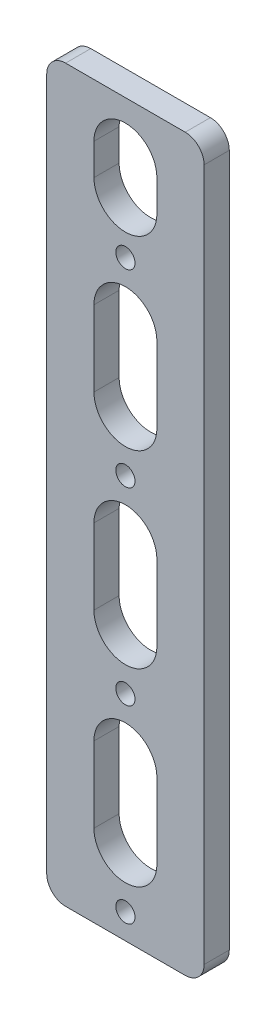
ISO-10303-21;
HEADER;
FILE_DESCRIPTION(('STEP AP214'),'2;1');
FILE_NAME('part.step','',(''),(''),'','','');
FILE_SCHEMA(('AUTOMOTIVE_DESIGN { 1 0 10303 214 1 1 1 1 }'));
ENDSEC;
DATA;
#1=APPLICATION_CONTEXT('core data for automotive mechanical design processes');
#2=APPLICATION_PROTOCOL_DEFINITION('international standard','automotive_design',2000,#1);
#3=PRODUCT_CONTEXT('',#1,'mechanical');
#4=PRODUCT('Part','Part','',(#3));
#5=PRODUCT_RELATED_PRODUCT_CATEGORY('part','',(#4));
#6=PRODUCT_DEFINITION_FORMATION('','',#4);
#7=PRODUCT_DEFINITION_CONTEXT('part definition',#1,'design');
#8=PRODUCT_DEFINITION('design','',#6,#7);
#9=PRODUCT_DEFINITION_SHAPE('','',#8);
#10=(LENGTH_UNIT() NAMED_UNIT(*) SI_UNIT(.MILLI.,.METRE.));
#11=(NAMED_UNIT(*) PLANE_ANGLE_UNIT() SI_UNIT($,.RADIAN.));
#12=(NAMED_UNIT(*) SI_UNIT($,.STERADIAN.) SOLID_ANGLE_UNIT());
#13=UNCERTAINTY_MEASURE_WITH_UNIT(LENGTH_MEASURE(1.E-05),#10,'distance_accuracy_value','');
#14=(GEOMETRIC_REPRESENTATION_CONTEXT(3) GLOBAL_UNCERTAINTY_ASSIGNED_CONTEXT((#13)) GLOBAL_UNIT_ASSIGNED_CONTEXT((#10,
#11,#12)) REPRESENTATION_CONTEXT('',''));
#15=CARTESIAN_POINT('',(0.,0.,0.));
#16=DIRECTION('',(0.,0.,1.));
#17=DIRECTION('',(1.,0.,0.));
#18=AXIS2_PLACEMENT_3D('',#15,#16,#17);
#19=CARTESIAN_POINT('',(12.5,-58.,4.));
#20=DIRECTION('',(-1.,0.,0.));
#21=DIRECTION('',(0.,0.,1.));
#22=AXIS2_PLACEMENT_3D('',#19,#20,#21);
#23=PLANE('',#22);
#24=DIRECTION('',(0.,1.,0.));
#25=VECTOR('',#24,1.);
#26=CARTESIAN_POINT('',(12.5,-58.,4.));
#27=LINE('',#26,#25);
#28=CARTESIAN_POINT('',(12.5,-55.,4.));
#29=VERTEX_POINT('',#28);
#30=CARTESIAN_POINT('',(12.5,55.,4.));
#31=VERTEX_POINT('',#30);
#32=EDGE_CURVE('E357',#29,#31,#27,.T.);
#33=ORIENTED_EDGE('',*,*,#32,.F.);
#34=DIRECTION('',(0.,0.,-1.));
#35=VECTOR('',#34,1.);
#36=CARTESIAN_POINT('',(12.5,-55.,4.));
#37=LINE('',#36,#35);
#38=CARTESIAN_POINT('',(12.5,-55.,0.));
#39=VERTEX_POINT('',#38);
#40=EDGE_CURVE('E382',#29,#39,#37,.T.);
#41=ORIENTED_EDGE('',*,*,#40,.T.);
#42=DIRECTION('',(0.,1.,0.));
#43=VECTOR('',#42,1.);
#44=CARTESIAN_POINT('',(12.5,-58.,0.));
#45=LINE('',#44,#43);
#46=CARTESIAN_POINT('',(12.5,55.,0.));
#47=VERTEX_POINT('',#46);
#48=EDGE_CURVE('E336',#39,#47,#45,.T.);
#49=ORIENTED_EDGE('',*,*,#48,.T.);
#50=DIRECTION('',(0.,0.,-1.));
#51=VECTOR('',#50,1.);
#52=CARTESIAN_POINT('',(12.5,55.,4.));
#53=LINE('',#52,#51);
#54=EDGE_CURVE('E370',#47,#31,#53,.F.);
#55=ORIENTED_EDGE('',*,*,#54,.T.);
#56=EDGE_LOOP('',(#33,#41,#49,#55));
#57=FACE_BOUND('',#56,.T.);
#58=ADVANCED_FACE('F36',(#57),#23,.F.);
#59=CARTESIAN_POINT('',(-12.5,58.,4.));
#60=DIRECTION('',(0.,-1.,0.));
#61=DIRECTION('',(0.,0.,-1.));
#62=AXIS2_PLACEMENT_3D('',#59,#60,#61);
#63=PLANE('',#62);
#64=DIRECTION('',(-1.,0.,0.));
#65=VECTOR('',#64,1.);
#66=CARTESIAN_POINT('',(-12.5,58.,4.));
#67=LINE('',#66,#65);
#68=CARTESIAN_POINT('',(9.5,58.,4.));
#69=VERTEX_POINT('',#68);
#70=CARTESIAN_POINT('',(-9.5,58.,4.));
#71=VERTEX_POINT('',#70);
#72=EDGE_CURVE('E360',#69,#71,#67,.T.);
#73=ORIENTED_EDGE('',*,*,#72,.F.);
#74=DIRECTION('',(0.,0.,-1.));
#75=VECTOR('',#74,1.);
#76=CARTESIAN_POINT('',(9.5,58.,4.));
#77=LINE('',#76,#75);
#78=CARTESIAN_POINT('',(9.5,58.,0.));
#79=VERTEX_POINT('',#78);
#80=EDGE_CURVE('E11',#69,#79,#77,.T.);
#81=ORIENTED_EDGE('',*,*,#80,.T.);
#82=DIRECTION('',(-1.,0.,0.));
#83=VECTOR('',#82,1.);
#84=CARTESIAN_POINT('',(-12.5,58.,0.));
#85=LINE('',#84,#83);
#86=CARTESIAN_POINT('',(-9.5,58.,0.));
#87=VERTEX_POINT('',#86);
#88=EDGE_CURVE('E373',#79,#87,#85,.T.);
#89=ORIENTED_EDGE('',*,*,#88,.T.);
#90=DIRECTION('',(0.,0.,-1.));
#91=VECTOR('',#90,1.);
#92=CARTESIAN_POINT('',(-9.5,58.,4.));
#93=LINE('',#92,#91);
#94=EDGE_CURVE('E44',#87,#71,#93,.F.);
#95=ORIENTED_EDGE('',*,*,#94,.T.);
#96=EDGE_LOOP('',(#73,#81,#89,#95));
#97=FACE_BOUND('',#96,.T.);
#98=ADVANCED_FACE('F413',(#97),#63,.F.);
#99=CARTESIAN_POINT('',(-12.5,-58.,4.));
#100=DIRECTION('',(1.,0.,0.));
#101=DIRECTION('',(0.,0.,-1.));
#102=AXIS2_PLACEMENT_3D('',#99,#100,#101);
#103=PLANE('',#102);
#104=DIRECTION('',(0.,-1.,0.));
#105=VECTOR('',#104,1.);
#106=CARTESIAN_POINT('',(-12.5,-58.,0.));
#107=LINE('',#106,#105);
#108=CARTESIAN_POINT('',(-12.5,55.,0.));
#109=VERTEX_POINT('',#108);
#110=CARTESIAN_POINT('',(-12.5,-55.,0.));
#111=VERTEX_POINT('',#110);
#112=EDGE_CURVE('E376',#109,#111,#107,.T.);
#113=ORIENTED_EDGE('',*,*,#112,.T.);
#114=DIRECTION('',(0.,0.,-1.));
#115=VECTOR('',#114,1.);
#116=CARTESIAN_POINT('',(-12.5,-55.,4.));
#117=LINE('',#116,#115);
#118=CARTESIAN_POINT('',(-12.5,-55.,4.));
#119=VERTEX_POINT('',#118);
#120=EDGE_CURVE('E409',#111,#119,#117,.F.);
#121=ORIENTED_EDGE('',*,*,#120,.T.);
#122=DIRECTION('',(0.,-1.,0.));
#123=VECTOR('',#122,1.);
#124=CARTESIAN_POINT('',(-12.5,-58.,4.));
#125=LINE('',#124,#123);
#126=CARTESIAN_POINT('',(-12.5,55.,4.));
#127=VERTEX_POINT('',#126);
#128=EDGE_CURVE('E364',#127,#119,#125,.T.);
#129=ORIENTED_EDGE('',*,*,#128,.F.);
#130=DIRECTION('',(0.,0.,-1.));
#131=VECTOR('',#130,1.);
#132=CARTESIAN_POINT('',(-12.5,55.,4.));
#133=LINE('',#132,#131);
#134=EDGE_CURVE('E406',#127,#109,#133,.T.);
#135=ORIENTED_EDGE('',*,*,#134,.T.);
#136=EDGE_LOOP('',(#113,#121,#129,#135));
#137=FACE_BOUND('',#136,.T.);
#138=ADVANCED_FACE('F425',(#137),#103,.F.);
#139=CARTESIAN_POINT('',(-12.5,-58.,4.));
#140=DIRECTION('',(0.,1.,0.));
#141=DIRECTION('',(0.,0.,1.));
#142=AXIS2_PLACEMENT_3D('',#139,#140,#141);
#143=PLANE('',#142);
#144=DIRECTION('',(1.,0.,0.));
#145=VECTOR('',#144,1.);
#146=CARTESIAN_POINT('',(-12.5,-58.,0.));
#147=LINE('',#146,#145);
#148=CARTESIAN_POINT('',(-9.5,-58.,0.));
#149=VERTEX_POINT('',#148);
#150=CARTESIAN_POINT('',(9.5,-58.,0.));
#151=VERTEX_POINT('',#150);
#152=EDGE_CURVE('E361',#149,#151,#147,.T.);
#153=ORIENTED_EDGE('',*,*,#152,.T.);
#154=DIRECTION('',(0.,0.,-1.));
#155=VECTOR('',#154,1.);
#156=CARTESIAN_POINT('',(9.5,-58.,4.));
#157=LINE('',#156,#155);
#158=CARTESIAN_POINT('',(9.5,-58.,4.));
#159=VERTEX_POINT('',#158);
#160=EDGE_CURVE('E396',#151,#159,#157,.F.);
#161=ORIENTED_EDGE('',*,*,#160,.T.);
#162=DIRECTION('',(1.,0.,0.));
#163=VECTOR('',#162,1.);
#164=CARTESIAN_POINT('',(-12.5,-58.,4.));
#165=LINE('',#164,#163);
#166=CARTESIAN_POINT('',(-9.5,-58.,4.));
#167=VERTEX_POINT('',#166);
#168=EDGE_CURVE('E367',#167,#159,#165,.T.);
#169=ORIENTED_EDGE('',*,*,#168,.F.);
#170=DIRECTION('',(0.,0.,-1.));
#171=VECTOR('',#170,1.);
#172=CARTESIAN_POINT('',(-9.5,-58.,4.));
#173=LINE('',#172,#171);
#174=EDGE_CURVE('E393',#167,#149,#173,.T.);
#175=ORIENTED_EDGE('',*,*,#174,.T.);
#176=EDGE_LOOP('',(#153,#161,#169,#175));
#177=FACE_BOUND('',#176,.T.);
#178=ADVANCED_FACE('F436',(#177),#143,.F.);
#179=CARTESIAN_POINT('',(0.,0.,4.));
#180=DIRECTION('',(0.,0.,-1.));
#181=DIRECTION('',(-1.,0.,0.));
#182=AXIS2_PLACEMENT_3D('',#179,#180,#181);
#183=PLANE('',#182);
#184=DIRECTION('',(0.,1.,0.));
#185=VECTOR('',#184,1.);
#186=CARTESIAN_POINT('',(5.,44.4999999994871,4.));
#187=LINE('',#186,#185);
#188=CARTESIAN_POINT('',(5.,44.4999999994871,4.));
#189=VERTEX_POINT('',#188);
#190=CARTESIAN_POINT('',(5.,49.4999999994871,4.));
#191=VERTEX_POINT('',#190);
#192=EDGE_CURVE('E287',#189,#191,#187,.T.);
#193=ORIENTED_EDGE('',*,*,#192,.F.);
#194=CARTESIAN_POINT('',(0.,44.4999999994871,4.));
#195=DIRECTION('',(0.,0.,1.));
#196=DIRECTION('',(1.,0.,0.));
#197=AXIS2_PLACEMENT_3D('',#194,#195,#196);
#198=CIRCLE('',#197,5.);
#199=CARTESIAN_POINT('',(-5.,44.4999999994871,4.));
#200=VERTEX_POINT('',#199);
#201=EDGE_CURVE('E51',#200,#189,#198,.T.);
#202=ORIENTED_EDGE('',*,*,#201,.F.);
#203=DIRECTION('',(0.,-1.,0.));
#204=VECTOR('',#203,1.);
#205=CARTESIAN_POINT('',(-5.,44.4999999994871,4.));
#206=LINE('',#205,#204);
#207=CARTESIAN_POINT('',(-5.,49.4999999994871,4.));
#208=VERTEX_POINT('',#207);
#209=EDGE_CURVE('E276',#208,#200,#206,.T.);
#210=ORIENTED_EDGE('',*,*,#209,.F.);
#211=CARTESIAN_POINT('',(0.,49.4999999994871,4.));
#212=DIRECTION('',(0.,0.,1.));
#213=DIRECTION('',(1.,0.,0.));
#214=AXIS2_PLACEMENT_3D('',#211,#212,#213);
#215=CIRCLE('',#214,5.);
#216=EDGE_CURVE('E290',#191,#208,#215,.T.);
#217=ORIENTED_EDGE('',*,*,#216,.F.);
#218=EDGE_LOOP('',(#193,#202,#210,#217));
#219=FACE_BOUND('',#218,.T.);
#220=DIRECTION('',(0.,1.,0.));
#221=VECTOR('',#220,1.);
#222=CARTESIAN_POINT('',(5.,-15.0000000005129,4.));
#223=LINE('',#222,#221);
#224=CARTESIAN_POINT('',(5.,-15.0000000005129,4.));
#225=VERTEX_POINT('',#224);
#226=CARTESIAN_POINT('',(4.99999999999999,-3.00000000051288,4.));
#227=VERTEX_POINT('',#226);
#228=EDGE_CURVE('E257',#225,#227,#223,.T.);
#229=ORIENTED_EDGE('',*,*,#228,.F.);
#230=CARTESIAN_POINT('',(0.,-15.0000000005129,4.));
#231=DIRECTION('',(0.,0.,1.));
#232=DIRECTION('',(1.,0.,0.));
#233=AXIS2_PLACEMENT_3D('',#230,#231,#232);
#234=CIRCLE('',#233,5.);
#235=CARTESIAN_POINT('',(-5.,-15.0000000005129,4.));
#236=VERTEX_POINT('',#235);
#237=EDGE_CURVE('E59',#236,#225,#234,.T.);
#238=ORIENTED_EDGE('',*,*,#237,.F.);
#239=DIRECTION('',(0.,-1.,0.));
#240=VECTOR('',#239,1.);
#241=CARTESIAN_POINT('',(-5.,-15.0000000005129,4.));
#242=LINE('',#241,#240);
#243=CARTESIAN_POINT('',(-5.00000000000001,-3.00000000051289,4.));
#244=VERTEX_POINT('',#243);
#245=EDGE_CURVE('E246',#244,#236,#242,.T.);
#246=ORIENTED_EDGE('',*,*,#245,.F.);
#247=CARTESIAN_POINT('',(0.,-3.00000000051288,4.));
#248=DIRECTION('',(0.,0.,1.));
#249=DIRECTION('',(1.,0.,0.));
#250=AXIS2_PLACEMENT_3D('',#247,#248,#249);
#251=CIRCLE('',#250,5.);
#252=EDGE_CURVE('E261',#227,#244,#251,.T.);
#253=ORIENTED_EDGE('',*,*,#252,.F.);
#254=EDGE_LOOP('',(#229,#238,#246,#253));
#255=FACE_BOUND('',#254,.T.);
#256=DIRECTION('',(0.,1.,0.));
#257=VECTOR('',#256,1.);
#258=CARTESIAN_POINT('',(5.,-45.0000000005129,4.));
#259=LINE('',#258,#257);
#260=CARTESIAN_POINT('',(5.,-45.0000000005129,4.));
#261=VERTEX_POINT('',#260);
#262=CARTESIAN_POINT('',(5.,-33.0000000005129,4.));
#263=VERTEX_POINT('',#262);
#264=EDGE_CURVE('E231',#261,#263,#259,.T.);
#265=ORIENTED_EDGE('',*,*,#264,.F.);
#266=CARTESIAN_POINT('',(0.,-45.0000000005129,4.));
#267=DIRECTION('',(0.,0.,1.));
#268=DIRECTION('',(1.,0.,0.));
#269=AXIS2_PLACEMENT_3D('',#266,#267,#268);
#270=CIRCLE('',#269,5.);
#271=CARTESIAN_POINT('',(-5.,-45.0000000005129,4.));
#272=VERTEX_POINT('',#271);
#273=EDGE_CURVE('E204',#272,#261,#270,.T.);
#274=ORIENTED_EDGE('',*,*,#273,.F.);
#275=DIRECTION('',(0.,-1.,0.));
#276=VECTOR('',#275,1.);
#277=CARTESIAN_POINT('',(-5.,-45.0000000005129,4.));
#278=LINE('',#277,#276);
#279=CARTESIAN_POINT('',(-5.,-33.0000000005129,4.));
#280=VERTEX_POINT('',#279);
#281=EDGE_CURVE('E222',#280,#272,#278,.T.);
#282=ORIENTED_EDGE('',*,*,#281,.F.);
#283=CARTESIAN_POINT('',(0.,-33.0000000005129,4.));
#284=DIRECTION('',(0.,0.,1.));
#285=DIRECTION('',(1.,0.,0.));
#286=AXIS2_PLACEMENT_3D('',#283,#284,#285);
#287=CIRCLE('',#286,5.);
#288=EDGE_CURVE('E225',#263,#280,#287,.T.);
#289=ORIENTED_EDGE('',*,*,#288,.F.);
#290=EDGE_LOOP('',(#265,#274,#282,#289));
#291=FACE_BOUND('',#290,.T.);
#292=DIRECTION('',(0.,1.,0.));
#293=VECTOR('',#292,1.);
#294=CARTESIAN_POINT('',(5.,14.9999999994871,4.));
#295=LINE('',#294,#293);
#296=CARTESIAN_POINT('',(5.,14.9999999994871,4.));
#297=VERTEX_POINT('',#296);
#298=CARTESIAN_POINT('',(5.,26.9999999994871,4.));
#299=VERTEX_POINT('',#298);
#300=EDGE_CURVE('E316',#297,#299,#295,.T.);
#301=ORIENTED_EDGE('',*,*,#300,.F.);
#302=CARTESIAN_POINT('',(0.,14.9999999994871,4.));
#303=DIRECTION('',(0.,0.,1.));
#304=DIRECTION('',(1.,0.,0.));
#305=AXIS2_PLACEMENT_3D('',#302,#303,#304);
#306=CIRCLE('',#305,5.);
#307=CARTESIAN_POINT('',(-5.,14.9999999994871,4.));
#308=VERTEX_POINT('',#307);
#309=EDGE_CURVE('E238',#308,#297,#306,.T.);
#310=ORIENTED_EDGE('',*,*,#309,.F.);
#311=DIRECTION('',(0.,-1.,0.));
#312=VECTOR('',#311,1.);
#313=CARTESIAN_POINT('',(-5.,14.9999999994871,4.));
#314=LINE('',#313,#312);
#315=CARTESIAN_POINT('',(-5.,26.9999999994871,4.));
#316=VERTEX_POINT('',#315);
#317=EDGE_CURVE('E305',#316,#308,#314,.T.);
#318=ORIENTED_EDGE('',*,*,#317,.F.);
#319=CARTESIAN_POINT('',(0.,26.9999999994871,4.));
#320=DIRECTION('',(0.,0.,1.));
#321=DIRECTION('',(1.,0.,0.));
#322=AXIS2_PLACEMENT_3D('',#319,#320,#321);
#323=CIRCLE('',#322,5.);
#324=EDGE_CURVE('E319',#299,#316,#323,.T.);
#325=ORIENTED_EDGE('',*,*,#324,.F.);
#326=EDGE_LOOP('',(#301,#310,#318,#325));
#327=FACE_BOUND('',#326,.T.);
#328=CARTESIAN_POINT('',(-2.56041262894584E-12,-54.0000000005129,4.));
#329=DIRECTION('',(0.,0.,-1.));
#330=DIRECTION('',(-1.,0.,0.));
#331=AXIS2_PLACEMENT_3D('',#328,#329,#330);
#332=CIRCLE('',#331,1.52500000048909);
#333=CARTESIAN_POINT('',(-1.52500000049166,-54.0000000005129,4.));
#334=VERTEX_POINT('',#333);
#335=EDGE_CURVE('E333',#334,#334,#332,.T.);
#336=ORIENTED_EDGE('',*,*,#335,.T.);
#337=EDGE_LOOP('',(#336));
#338=FACE_BOUND('',#337,.T.);
#339=CARTESIAN_POINT('',(-2.55720663240154E-12,-24.0000000005129,4.));
#340=DIRECTION('',(0.,0.,-1.));
#341=DIRECTION('',(-1.,0.,0.));
#342=AXIS2_PLACEMENT_3D('',#339,#340,#341);
#343=CIRCLE('',#342,1.5250000004891);
#344=CARTESIAN_POINT('',(-1.52500000049165,-24.0000000005129,4.));
#345=VERTEX_POINT('',#344);
#346=EDGE_CURVE('E340',#345,#345,#343,.T.);
#347=ORIENTED_EDGE('',*,*,#346,.T.);
#348=EDGE_LOOP('',(#347));
#349=FACE_BOUND('',#348,.T.);
#350=CARTESIAN_POINT('',(-2.55400063585724E-12,5.99999999948711,4.));
#351=DIRECTION('',(0.,0.,-1.));
#352=DIRECTION('',(-1.,0.,0.));
#353=AXIS2_PLACEMENT_3D('',#350,#351,#352);
#354=CIRCLE('',#353,1.5250000004891);
#355=CARTESIAN_POINT('',(-1.52500000049165,5.99999999948711,4.));
#356=VERTEX_POINT('',#355);
#357=EDGE_CURVE('E346',#356,#356,#354,.T.);
#358=ORIENTED_EDGE('',*,*,#357,.T.);
#359=EDGE_LOOP('',(#358));
#360=FACE_BOUND('',#359,.T.);
#361=CARTESIAN_POINT('',(-2.55079463931294E-12,35.9999999994871,4.));
#362=DIRECTION('',(0.,0.,-1.));
#363=DIRECTION('',(-1.,0.,0.));
#364=AXIS2_PLACEMENT_3D('',#361,#362,#363);
#365=CIRCLE('',#364,1.52500000048909);
#366=CARTESIAN_POINT('',(-1.52500000049165,35.9999999994871,4.));
#367=VERTEX_POINT('',#366);
#368=EDGE_CURVE('E352',#367,#367,#365,.T.);
#369=ORIENTED_EDGE('',*,*,#368,.T.);
#370=EDGE_LOOP('',(#369));
#371=FACE_BOUND('',#370,.T.);
#372=ORIENTED_EDGE('',*,*,#168,.T.);
#373=CARTESIAN_POINT('',(9.5,-55.,4.));
#374=DIRECTION('',(0.,0.,-1.));
#375=DIRECTION('',(-1.,0.,0.));
#376=AXIS2_PLACEMENT_3D('',#373,#374,#375);
#377=CIRCLE('',#376,3.);
#378=EDGE_CURVE('E404',#159,#29,#377,.F.);
#379=ORIENTED_EDGE('',*,*,#378,.T.);
#380=ORIENTED_EDGE('',*,*,#32,.T.);
#381=CARTESIAN_POINT('',(9.5,55.,4.));
#382=DIRECTION('',(0.,0.,-1.));
#383=DIRECTION('',(-1.,0.,0.));
#384=AXIS2_PLACEMENT_3D('',#381,#382,#383);
#385=CIRCLE('',#384,3.);
#386=EDGE_CURVE('E400',#31,#69,#385,.F.);
#387=ORIENTED_EDGE('',*,*,#386,.T.);
#388=ORIENTED_EDGE('',*,*,#72,.T.);
#389=CARTESIAN_POINT('',(-9.5,55.,4.));
#390=DIRECTION('',(0.,0.,-1.));
#391=DIRECTION('',(-1.,0.,0.));
#392=AXIS2_PLACEMENT_3D('',#389,#390,#391);
#393=CIRCLE('',#392,3.);
#394=EDGE_CURVE('E398',#71,#127,#393,.F.);
#395=ORIENTED_EDGE('',*,*,#394,.T.);
#396=ORIENTED_EDGE('',*,*,#128,.T.);
#397=CARTESIAN_POINT('',(-9.5,-55.,4.));
#398=DIRECTION('',(0.,0.,-1.));
#399=DIRECTION('',(-1.,0.,0.));
#400=AXIS2_PLACEMENT_3D('',#397,#398,#399);
#401=CIRCLE('',#400,3.);
#402=EDGE_CURVE('E402',#119,#167,#401,.F.);
#403=ORIENTED_EDGE('',*,*,#402,.T.);
#404=EDGE_LOOP('',(#372,#379,#380,#387,#388,#395,#396,#403));
#405=FACE_BOUND('',#404,.T.);
#406=ADVANCED_FACE('F419',(#219,#255,#291,#327,#338,#349,#360,#371,#405),#183,.F.);
#407=CARTESIAN_POINT('',(0.,0.,0.));
#408=DIRECTION('',(0.,0.,-1.));
#409=DIRECTION('',(-1.,0.,0.));
#410=AXIS2_PLACEMENT_3D('',#407,#408,#409);
#411=PLANE('',#410);
#412=CARTESIAN_POINT('',(0.,44.4999999994871,0.));
#413=DIRECTION('',(0.,0.,1.));
#414=DIRECTION('',(1.,0.,0.));
#415=AXIS2_PLACEMENT_3D('',#412,#413,#414);
#416=CIRCLE('',#415,5.);
#417=CARTESIAN_POINT('',(-5.,44.4999999994871,0.));
#418=VERTEX_POINT('',#417);
#419=CARTESIAN_POINT('',(5.,44.4999999994871,0.));
#420=VERTEX_POINT('',#419);
#421=EDGE_CURVE('E272',#418,#420,#416,.T.);
#422=ORIENTED_EDGE('',*,*,#421,.T.);
#423=DIRECTION('',(0.,1.,0.));
#424=VECTOR('',#423,1.);
#425=CARTESIAN_POINT('',(5.,44.4999999994871,0.));
#426=LINE('',#425,#424);
#427=CARTESIAN_POINT('',(5.,49.4999999994871,0.));
#428=VERTEX_POINT('',#427);
#429=EDGE_CURVE('E275',#420,#428,#426,.T.);
#430=ORIENTED_EDGE('',*,*,#429,.T.);
#431=CARTESIAN_POINT('',(0.,49.4999999994871,0.));
#432=DIRECTION('',(0.,0.,1.));
#433=DIRECTION('',(1.,0.,0.));
#434=AXIS2_PLACEMENT_3D('',#431,#432,#433);
#435=CIRCLE('',#434,5.);
#436=CARTESIAN_POINT('',(-5.,49.4999999994871,0.));
#437=VERTEX_POINT('',#436);
#438=EDGE_CURVE('E279',#428,#437,#435,.T.);
#439=ORIENTED_EDGE('',*,*,#438,.T.);
#440=DIRECTION('',(0.,-1.,0.));
#441=VECTOR('',#440,1.);
#442=CARTESIAN_POINT('',(-5.,44.4999999994871,0.));
#443=LINE('',#442,#441);
#444=EDGE_CURVE('E282',#437,#418,#443,.T.);
#445=ORIENTED_EDGE('',*,*,#444,.T.);
#446=EDGE_LOOP('',(#422,#430,#439,#445));
#447=FACE_BOUND('',#446,.T.);
#448=CARTESIAN_POINT('',(0.,-15.0000000005129,0.));
#449=DIRECTION('',(0.,0.,1.));
#450=DIRECTION('',(1.,0.,0.));
#451=AXIS2_PLACEMENT_3D('',#448,#449,#450);
#452=CIRCLE('',#451,5.);
#453=CARTESIAN_POINT('',(-5.,-15.0000000005129,0.));
#454=VERTEX_POINT('',#453);
#455=CARTESIAN_POINT('',(5.,-15.0000000005129,0.));
#456=VERTEX_POINT('',#455);
#457=EDGE_CURVE('E242',#454,#456,#452,.T.);
#458=ORIENTED_EDGE('',*,*,#457,.T.);
#459=DIRECTION('',(0.,1.,0.));
#460=VECTOR('',#459,1.);
#461=CARTESIAN_POINT('',(5.,-15.0000000005129,0.));
#462=LINE('',#461,#460);
#463=CARTESIAN_POINT('',(4.99999999999999,-3.00000000051288,0.));
#464=VERTEX_POINT('',#463);
#465=EDGE_CURVE('E245',#456,#464,#462,.T.);
#466=ORIENTED_EDGE('',*,*,#465,.T.);
#467=CARTESIAN_POINT('',(0.,-3.00000000051288,0.));
#468=DIRECTION('',(0.,0.,1.));
#469=DIRECTION('',(1.,0.,0.));
#470=AXIS2_PLACEMENT_3D('',#467,#468,#469);
#471=CIRCLE('',#470,5.);
#472=CARTESIAN_POINT('',(-5.00000000000001,-3.00000000051289,0.));
#473=VERTEX_POINT('',#472);
#474=EDGE_CURVE('E249',#464,#473,#471,.T.);
#475=ORIENTED_EDGE('',*,*,#474,.T.);
#476=DIRECTION('',(0.,-1.,0.));
#477=VECTOR('',#476,1.);
#478=CARTESIAN_POINT('',(-5.,-15.0000000005129,0.));
#479=LINE('',#478,#477);
#480=EDGE_CURVE('E252',#473,#454,#479,.T.);
#481=ORIENTED_EDGE('',*,*,#480,.T.);
#482=EDGE_LOOP('',(#458,#466,#475,#481));
#483=FACE_BOUND('',#482,.T.);
#484=CARTESIAN_POINT('',(0.,-45.0000000005129,0.));
#485=DIRECTION('',(0.,0.,1.));
#486=DIRECTION('',(1.,0.,0.));
#487=AXIS2_PLACEMENT_3D('',#484,#485,#486);
#488=CIRCLE('',#487,5.);
#489=CARTESIAN_POINT('',(-5.,-45.0000000005129,0.));
#490=VERTEX_POINT('',#489);
#491=CARTESIAN_POINT('',(5.,-45.0000000005129,0.));
#492=VERTEX_POINT('',#491);
#493=EDGE_CURVE('E201',#490,#492,#488,.T.);
#494=ORIENTED_EDGE('',*,*,#493,.T.);
#495=DIRECTION('',(0.,1.,0.));
#496=VECTOR('',#495,1.);
#497=CARTESIAN_POINT('',(5.,-45.0000000005129,0.));
#498=LINE('',#497,#496);
#499=CARTESIAN_POINT('',(5.,-33.0000000005129,0.));
#500=VERTEX_POINT('',#499);
#501=EDGE_CURVE('E213',#492,#500,#498,.T.);
#502=ORIENTED_EDGE('',*,*,#501,.T.);
#503=CARTESIAN_POINT('',(0.,-33.0000000005129,0.));
#504=DIRECTION('',(0.,0.,1.));
#505=DIRECTION('',(1.,0.,0.));
#506=AXIS2_PLACEMENT_3D('',#503,#504,#505);
#507=CIRCLE('',#506,5.);
#508=CARTESIAN_POINT('',(-5.,-33.0000000005129,0.));
#509=VERTEX_POINT('',#508);
#510=EDGE_CURVE('E217',#500,#509,#507,.T.);
#511=ORIENTED_EDGE('',*,*,#510,.T.);
#512=DIRECTION('',(0.,-1.,0.));
#513=VECTOR('',#512,1.);
#514=CARTESIAN_POINT('',(-5.,-45.0000000005129,0.));
#515=LINE('',#514,#513);
#516=EDGE_CURVE('E209',#509,#490,#515,.T.);
#517=ORIENTED_EDGE('',*,*,#516,.T.);
#518=EDGE_LOOP('',(#494,#502,#511,#517));
#519=FACE_BOUND('',#518,.T.);
#520=CARTESIAN_POINT('',(0.,14.9999999994871,0.));
#521=DIRECTION('',(0.,0.,1.));
#522=DIRECTION('',(1.,0.,0.));
#523=AXIS2_PLACEMENT_3D('',#520,#521,#522);
#524=CIRCLE('',#523,5.);
#525=CARTESIAN_POINT('',(-5.,14.9999999994871,0.));
#526=VERTEX_POINT('',#525);
#527=CARTESIAN_POINT('',(5.,14.9999999994871,0.));
#528=VERTEX_POINT('',#527);
#529=EDGE_CURVE('E301',#526,#528,#524,.T.);
#530=ORIENTED_EDGE('',*,*,#529,.T.);
#531=DIRECTION('',(0.,1.,0.));
#532=VECTOR('',#531,1.);
#533=CARTESIAN_POINT('',(5.,14.9999999994871,0.));
#534=LINE('',#533,#532);
#535=CARTESIAN_POINT('',(4.99999999999999,26.9999999994871,0.));
#536=VERTEX_POINT('',#535);
#537=EDGE_CURVE('E304',#528,#536,#534,.T.);
#538=ORIENTED_EDGE('',*,*,#537,.T.);
#539=CARTESIAN_POINT('',(0.,26.9999999994871,0.));
#540=DIRECTION('',(0.,0.,1.));
#541=DIRECTION('',(1.,0.,0.));
#542=AXIS2_PLACEMENT_3D('',#539,#540,#541);
#543=CIRCLE('',#542,5.);
#544=CARTESIAN_POINT('',(-5.,26.9999999994871,0.));
#545=VERTEX_POINT('',#544);
#546=EDGE_CURVE('E308',#536,#545,#543,.T.);
#547=ORIENTED_EDGE('',*,*,#546,.T.);
#548=DIRECTION('',(0.,-1.,0.));
#549=VECTOR('',#548,1.);
#550=CARTESIAN_POINT('',(-5.,14.9999999994871,0.));
#551=LINE('',#550,#549);
#552=EDGE_CURVE('E311',#545,#526,#551,.T.);
#553=ORIENTED_EDGE('',*,*,#552,.T.);
#554=EDGE_LOOP('',(#530,#538,#547,#553));
#555=FACE_BOUND('',#554,.T.);
#556=CARTESIAN_POINT('',(-2.56041262894584E-12,-54.0000000005129,0.));
#557=DIRECTION('',(0.,0.,-1.));
#558=DIRECTION('',(-1.,0.,0.));
#559=AXIS2_PLACEMENT_3D('',#556,#557,#558);
#560=CIRCLE('',#559,1.52500000048909);
#561=CARTESIAN_POINT('',(-1.52500000049166,-54.0000000005129,0.));
#562=VERTEX_POINT('',#561);
#563=EDGE_CURVE('E337',#562,#562,#560,.T.);
#564=ORIENTED_EDGE('',*,*,#563,.F.);
#565=EDGE_LOOP('',(#564));
#566=FACE_BOUND('',#565,.T.);
#567=CARTESIAN_POINT('',(-2.55720663240154E-12,-24.0000000005129,0.));
#568=DIRECTION('',(0.,0.,-1.));
#569=DIRECTION('',(-1.,0.,0.));
#570=AXIS2_PLACEMENT_3D('',#567,#568,#569);
#571=CIRCLE('',#570,1.5250000004891);
#572=CARTESIAN_POINT('',(-1.52500000049165,-24.0000000005129,0.));
#573=VERTEX_POINT('',#572);
#574=EDGE_CURVE('E343',#573,#573,#571,.T.);
#575=ORIENTED_EDGE('',*,*,#574,.F.);
#576=EDGE_LOOP('',(#575));
#577=FACE_BOUND('',#576,.T.);
#578=CARTESIAN_POINT('',(-2.55400063585724E-12,5.99999999948711,0.));
#579=DIRECTION('',(0.,0.,-1.));
#580=DIRECTION('',(-1.,0.,0.));
#581=AXIS2_PLACEMENT_3D('',#578,#579,#580);
#582=CIRCLE('',#581,1.5250000004891);
#583=CARTESIAN_POINT('',(-1.52500000049165,5.99999999948711,0.));
#584=VERTEX_POINT('',#583);
#585=EDGE_CURVE('E349',#584,#584,#582,.T.);
#586=ORIENTED_EDGE('',*,*,#585,.F.);
#587=EDGE_LOOP('',(#586));
#588=FACE_BOUND('',#587,.T.);
#589=CARTESIAN_POINT('',(-2.55079463931294E-12,35.9999999994871,0.));
#590=DIRECTION('',(0.,0.,-1.));
#591=DIRECTION('',(-1.,0.,0.));
#592=AXIS2_PLACEMENT_3D('',#589,#590,#591);
#593=CIRCLE('',#592,1.52500000048909);
#594=CARTESIAN_POINT('',(-1.52500000049165,35.9999999994871,0.));
#595=VERTEX_POINT('',#594);
#596=EDGE_CURVE('E326',#595,#595,#593,.T.);
#597=ORIENTED_EDGE('',*,*,#596,.F.);
#598=EDGE_LOOP('',(#597));
#599=FACE_BOUND('',#598,.T.);
#600=ORIENTED_EDGE('',*,*,#48,.F.);
#601=CARTESIAN_POINT('',(9.5,-55.,0.));
#602=DIRECTION('',(0.,0.,-1.));
#603=DIRECTION('',(-1.,0.,0.));
#604=AXIS2_PLACEMENT_3D('',#601,#602,#603);
#605=CIRCLE('',#604,3.);
#606=EDGE_CURVE('E391',#39,#151,#605,.T.);
#607=ORIENTED_EDGE('',*,*,#606,.T.);
#608=ORIENTED_EDGE('',*,*,#152,.F.);
#609=CARTESIAN_POINT('',(-9.5,-55.,0.));
#610=DIRECTION('',(0.,0.,-1.));
#611=DIRECTION('',(-1.,0.,0.));
#612=AXIS2_PLACEMENT_3D('',#609,#610,#611);
#613=CIRCLE('',#612,3.);
#614=EDGE_CURVE('E389',#149,#111,#613,.T.);
#615=ORIENTED_EDGE('',*,*,#614,.T.);
#616=ORIENTED_EDGE('',*,*,#112,.F.);
#617=CARTESIAN_POINT('',(-9.5,55.,0.));
#618=DIRECTION('',(0.,0.,-1.));
#619=DIRECTION('',(-1.,0.,0.));
#620=AXIS2_PLACEMENT_3D('',#617,#618,#619);
#621=CIRCLE('',#620,3.);
#622=EDGE_CURVE('E385',#109,#87,#621,.T.);
#623=ORIENTED_EDGE('',*,*,#622,.T.);
#624=ORIENTED_EDGE('',*,*,#88,.F.);
#625=CARTESIAN_POINT('',(9.5,55.,0.));
#626=DIRECTION('',(0.,0.,-1.));
#627=DIRECTION('',(-1.,0.,0.));
#628=AXIS2_PLACEMENT_3D('',#625,#626,#627);
#629=CIRCLE('',#628,3.);
#630=EDGE_CURVE('E387',#79,#47,#629,.T.);
#631=ORIENTED_EDGE('',*,*,#630,.T.);
#632=EDGE_LOOP('',(#600,#607,#608,#615,#616,#623,#624,#631));
#633=FACE_BOUND('',#632,.T.);
#634=ADVANCED_FACE('F219',(#447,#483,#519,#555,#566,#577,#588,#599,#633),#411,.T.);
#635=CARTESIAN_POINT('',(-2.55079463931294E-12,35.9999999994871,4.));
#636=DIRECTION('',(0.,0.,-1.));
#637=DIRECTION('',(-1.,0.,0.));
#638=AXIS2_PLACEMENT_3D('',#635,#636,#637);
#639=CYLINDRICAL_SURFACE('',#638,1.52500000048909);
#640=ORIENTED_EDGE('',*,*,#368,.F.);
#641=EDGE_LOOP('',(#640));
#642=FACE_BOUND('',#641,.T.);
#643=ORIENTED_EDGE('',*,*,#596,.T.);
#644=EDGE_LOOP('',(#643));
#645=FACE_BOUND('',#644,.T.);
#646=ADVANCED_FACE('F483',(#642,#645),#639,.F.);
#647=CARTESIAN_POINT('',(-2.55400063585724E-12,5.99999999948711,4.));
#648=DIRECTION('',(0.,0.,-1.));
#649=DIRECTION('',(-1.,0.,0.));
#650=AXIS2_PLACEMENT_3D('',#647,#648,#649);
#651=CYLINDRICAL_SURFACE('',#650,1.5250000004891);
#652=ORIENTED_EDGE('',*,*,#357,.F.);
#653=EDGE_LOOP('',(#652));
#654=FACE_BOUND('',#653,.T.);
#655=ORIENTED_EDGE('',*,*,#585,.T.);
#656=EDGE_LOOP('',(#655));
#657=FACE_BOUND('',#656,.T.);
#658=ADVANCED_FACE('F473',(#654,#657),#651,.F.);
#659=CARTESIAN_POINT('',(-2.55720663240154E-12,-24.0000000005129,4.));
#660=DIRECTION('',(0.,0.,-1.));
#661=DIRECTION('',(-1.,0.,0.));
#662=AXIS2_PLACEMENT_3D('',#659,#660,#661);
#663=CYLINDRICAL_SURFACE('',#662,1.5250000004891);
#664=ORIENTED_EDGE('',*,*,#346,.F.);
#665=EDGE_LOOP('',(#664));
#666=FACE_BOUND('',#665,.T.);
#667=ORIENTED_EDGE('',*,*,#574,.T.);
#668=EDGE_LOOP('',(#667));
#669=FACE_BOUND('',#668,.T.);
#670=ADVANCED_FACE('F467',(#666,#669),#663,.F.);
#671=CARTESIAN_POINT('',(-2.56041262894584E-12,-54.0000000005129,4.));
#672=DIRECTION('',(0.,0.,-1.));
#673=DIRECTION('',(-1.,0.,0.));
#674=AXIS2_PLACEMENT_3D('',#671,#672,#673);
#675=CYLINDRICAL_SURFACE('',#674,1.52500000048909);
#676=ORIENTED_EDGE('',*,*,#335,.F.);
#677=EDGE_LOOP('',(#676));
#678=FACE_BOUND('',#677,.T.);
#679=ORIENTED_EDGE('',*,*,#563,.T.);
#680=EDGE_LOOP('',(#679));
#681=FACE_BOUND('',#680,.T.);
#682=ADVANCED_FACE('F463',(#678,#681),#675,.F.);
#683=CARTESIAN_POINT('',(9.5,-55.,4.));
#684=DIRECTION('',(0.,0.,-1.));
#685=DIRECTION('',(-1.,0.,0.));
#686=AXIS2_PLACEMENT_3D('',#683,#684,#685);
#687=CYLINDRICAL_SURFACE('',#686,3.);
#688=ORIENTED_EDGE('',*,*,#378,.F.);
#689=ORIENTED_EDGE('',*,*,#160,.F.);
#690=ORIENTED_EDGE('',*,*,#606,.F.);
#691=ORIENTED_EDGE('',*,*,#40,.F.);
#692=EDGE_LOOP('',(#688,#689,#690,#691));
#693=FACE_BOUND('',#692,.T.);
#694=ADVANCED_FACE('F442',(#693),#687,.T.);
#695=CARTESIAN_POINT('',(-9.5,-55.,4.));
#696=DIRECTION('',(0.,0.,-1.));
#697=DIRECTION('',(-1.,0.,0.));
#698=AXIS2_PLACEMENT_3D('',#695,#696,#697);
#699=CYLINDRICAL_SURFACE('',#698,3.);
#700=ORIENTED_EDGE('',*,*,#402,.F.);
#701=ORIENTED_EDGE('',*,*,#120,.F.);
#702=ORIENTED_EDGE('',*,*,#614,.F.);
#703=ORIENTED_EDGE('',*,*,#174,.F.);
#704=EDGE_LOOP('',(#700,#701,#702,#703));
#705=FACE_BOUND('',#704,.T.);
#706=ADVANCED_FACE('F433',(#705),#699,.T.);
#707=CARTESIAN_POINT('',(9.5,55.,4.));
#708=DIRECTION('',(0.,0.,-1.));
#709=DIRECTION('',(-1.,0.,0.));
#710=AXIS2_PLACEMENT_3D('',#707,#708,#709);
#711=CYLINDRICAL_SURFACE('',#710,3.);
#712=ORIENTED_EDGE('',*,*,#386,.F.);
#713=ORIENTED_EDGE('',*,*,#54,.F.);
#714=ORIENTED_EDGE('',*,*,#630,.F.);
#715=ORIENTED_EDGE('',*,*,#80,.F.);
#716=EDGE_LOOP('',(#712,#713,#714,#715));
#717=FACE_BOUND('',#716,.T.);
#718=ADVANCED_FACE('F446',(#717),#711,.T.);
#719=CARTESIAN_POINT('',(-9.5,55.,4.));
#720=DIRECTION('',(0.,0.,-1.));
#721=DIRECTION('',(-1.,0.,0.));
#722=AXIS2_PLACEMENT_3D('',#719,#720,#721);
#723=CYLINDRICAL_SURFACE('',#722,3.);
#724=ORIENTED_EDGE('',*,*,#394,.F.);
#725=ORIENTED_EDGE('',*,*,#94,.F.);
#726=ORIENTED_EDGE('',*,*,#622,.F.);
#727=ORIENTED_EDGE('',*,*,#134,.F.);
#728=EDGE_LOOP('',(#724,#725,#726,#727));
#729=FACE_BOUND('',#728,.T.);
#730=ADVANCED_FACE('F38',(#729),#723,.T.);
#731=CARTESIAN_POINT('',(0.,14.9999999994871,0.));
#732=DIRECTION('',(0.,0.,1.));
#733=DIRECTION('',(1.,0.,0.));
#734=AXIS2_PLACEMENT_3D('',#731,#732,#733);
#735=CYLINDRICAL_SURFACE('',#734,5.);
#736=ORIENTED_EDGE('',*,*,#309,.T.);
#737=DIRECTION('',(0.,0.,1.));
#738=VECTOR('',#737,1.);
#739=CARTESIAN_POINT('',(5.,14.9999999994871,0.));
#740=LINE('',#739,#738);
#741=EDGE_CURVE('E314',#528,#297,#740,.T.);
#742=ORIENTED_EDGE('',*,*,#741,.F.);
#743=ORIENTED_EDGE('',*,*,#529,.F.);
#744=DIRECTION('',(0.,0.,1.));
#745=VECTOR('',#744,1.);
#746=CARTESIAN_POINT('',(-5.,14.9999999994871,0.));
#747=LINE('',#746,#745);
#748=EDGE_CURVE('E324',#526,#308,#747,.T.);
#749=ORIENTED_EDGE('',*,*,#748,.T.);
#750=EDGE_LOOP('',(#736,#742,#743,#749));
#751=FACE_BOUND('',#750,.T.);
#752=ADVANCED_FACE('F452',(#751),#735,.F.);
#753=CARTESIAN_POINT('',(-5.,14.9999999994871,0.));
#754=DIRECTION('',(-1.,0.,0.));
#755=DIRECTION('',(0.,-1.,0.));
#756=AXIS2_PLACEMENT_3D('',#753,#754,#755);
#757=PLANE('',#756);
#758=ORIENTED_EDGE('',*,*,#317,.T.);
#759=ORIENTED_EDGE('',*,*,#748,.F.);
#760=ORIENTED_EDGE('',*,*,#552,.F.);
#761=DIRECTION('',(0.,0.,1.));
#762=VECTOR('',#761,1.);
#763=CARTESIAN_POINT('',(-5.,26.9999999994871,0.));
#764=LINE('',#763,#762);
#765=EDGE_CURVE('E327',#545,#316,#764,.T.);
#766=ORIENTED_EDGE('',*,*,#765,.T.);
#767=EDGE_LOOP('',(#758,#759,#760,#766));
#768=FACE_BOUND('',#767,.T.);
#769=ADVANCED_FACE('F576',(#768),#757,.F.);
#770=CARTESIAN_POINT('',(0.,26.9999999994871,0.));
#771=DIRECTION('',(0.,0.,1.));
#772=DIRECTION('',(1.,0.,0.));
#773=AXIS2_PLACEMENT_3D('',#770,#771,#772);
#774=CYLINDRICAL_SURFACE('',#773,5.);
#775=ORIENTED_EDGE('',*,*,#324,.T.);
#776=ORIENTED_EDGE('',*,*,#765,.F.);
#777=ORIENTED_EDGE('',*,*,#546,.F.);
#778=DIRECTION('',(0.,0.,1.));
#779=VECTOR('',#778,1.);
#780=CARTESIAN_POINT('',(5.,26.9999999994871,0.));
#781=LINE('',#780,#779);
#782=EDGE_CURVE('E329',#536,#299,#781,.T.);
#783=ORIENTED_EDGE('',*,*,#782,.T.);
#784=EDGE_LOOP('',(#775,#776,#777,#783));
#785=FACE_BOUND('',#784,.T.);
#786=ADVANCED_FACE('F584',(#785),#774,.F.);
#787=CARTESIAN_POINT('',(5.,14.9999999994871,0.));
#788=DIRECTION('',(1.,0.,0.));
#789=DIRECTION('',(0.,1.,0.));
#790=AXIS2_PLACEMENT_3D('',#787,#788,#789);
#791=PLANE('',#790);
#792=ORIENTED_EDGE('',*,*,#300,.T.);
#793=ORIENTED_EDGE('',*,*,#782,.F.);
#794=ORIENTED_EDGE('',*,*,#537,.F.);
#795=ORIENTED_EDGE('',*,*,#741,.T.);
#796=EDGE_LOOP('',(#792,#793,#794,#795));
#797=FACE_BOUND('',#796,.T.);
#798=ADVANCED_FACE('F593',(#797),#791,.F.);
#799=CARTESIAN_POINT('',(0.,-45.0000000005129,0.));
#800=DIRECTION('',(0.,0.,1.));
#801=DIRECTION('',(1.,0.,0.));
#802=AXIS2_PLACEMENT_3D('',#799,#800,#801);
#803=CYLINDRICAL_SURFACE('',#802,5.);
#804=ORIENTED_EDGE('',*,*,#273,.T.);
#805=DIRECTION('',(0.,0.,1.));
#806=VECTOR('',#805,1.);
#807=CARTESIAN_POINT('',(5.,-45.0000000005129,0.));
#808=LINE('',#807,#806);
#809=EDGE_CURVE('E197',#492,#261,#808,.T.);
#810=ORIENTED_EDGE('',*,*,#809,.F.);
#811=ORIENTED_EDGE('',*,*,#493,.F.);
#812=DIRECTION('',(0.,0.,1.));
#813=VECTOR('',#812,1.);
#814=CARTESIAN_POINT('',(-5.,-45.0000000005129,0.));
#815=LINE('',#814,#813);
#816=EDGE_CURVE('E236',#490,#272,#815,.T.);
#817=ORIENTED_EDGE('',*,*,#816,.T.);
#818=EDGE_LOOP('',(#804,#810,#811,#817));
#819=FACE_BOUND('',#818,.T.);
#820=ADVANCED_FACE('F199',(#819),#803,.F.);
#821=CARTESIAN_POINT('',(-5.,-45.0000000005129,0.));
#822=DIRECTION('',(-1.,0.,0.));
#823=DIRECTION('',(0.,-1.,0.));
#824=AXIS2_PLACEMENT_3D('',#821,#822,#823);
#825=PLANE('',#824);
#826=ORIENTED_EDGE('',*,*,#281,.T.);
#827=ORIENTED_EDGE('',*,*,#816,.F.);
#828=ORIENTED_EDGE('',*,*,#516,.F.);
#829=DIRECTION('',(0.,0.,1.));
#830=VECTOR('',#829,1.);
#831=CARTESIAN_POINT('',(-5.,-33.0000000005129,0.));
#832=LINE('',#831,#830);
#833=EDGE_CURVE('E239',#509,#280,#832,.T.);
#834=ORIENTED_EDGE('',*,*,#833,.T.);
#835=EDGE_LOOP('',(#826,#827,#828,#834));
#836=FACE_BOUND('',#835,.T.);
#837=ADVANCED_FACE('F609',(#836),#825,.F.);
#838=CARTESIAN_POINT('',(0.,-33.0000000005129,0.));
#839=DIRECTION('',(0.,0.,1.));
#840=DIRECTION('',(1.,0.,0.));
#841=AXIS2_PLACEMENT_3D('',#838,#839,#840);
#842=CYLINDRICAL_SURFACE('',#841,5.);
#843=ORIENTED_EDGE('',*,*,#288,.T.);
#844=ORIENTED_EDGE('',*,*,#833,.F.);
#845=ORIENTED_EDGE('',*,*,#510,.F.);
#846=DIRECTION('',(0.,0.,1.));
#847=VECTOR('',#846,1.);
#848=CARTESIAN_POINT('',(5.,-33.0000000005129,0.));
#849=LINE('',#848,#847);
#850=EDGE_CURVE('E208',#500,#263,#849,.T.);
#851=ORIENTED_EDGE('',*,*,#850,.T.);
#852=EDGE_LOOP('',(#843,#844,#845,#851));
#853=FACE_BOUND('',#852,.T.);
#854=ADVANCED_FACE('F617',(#853),#842,.F.);
#855=CARTESIAN_POINT('',(5.,-45.0000000005129,0.));
#856=DIRECTION('',(1.,0.,0.));
#857=DIRECTION('',(0.,1.,0.));
#858=AXIS2_PLACEMENT_3D('',#855,#856,#857);
#859=PLANE('',#858);
#860=ORIENTED_EDGE('',*,*,#264,.T.);
#861=ORIENTED_EDGE('',*,*,#850,.F.);
#862=ORIENTED_EDGE('',*,*,#501,.F.);
#863=ORIENTED_EDGE('',*,*,#809,.T.);
#864=EDGE_LOOP('',(#860,#861,#862,#863));
#865=FACE_BOUND('',#864,.T.);
#866=ADVANCED_FACE('F214',(#865),#859,.F.);
#867=CARTESIAN_POINT('',(0.,-15.0000000005129,0.));
#868=DIRECTION('',(0.,0.,1.));
#869=DIRECTION('',(1.,0.,0.));
#870=AXIS2_PLACEMENT_3D('',#867,#868,#869);
#871=CYLINDRICAL_SURFACE('',#870,5.);
#872=ORIENTED_EDGE('',*,*,#237,.T.);
#873=DIRECTION('',(0.,0.,1.));
#874=VECTOR('',#873,1.);
#875=CARTESIAN_POINT('',(5.,-15.0000000005129,0.));
#876=LINE('',#875,#874);
#877=EDGE_CURVE('E255',#456,#225,#876,.T.);
#878=ORIENTED_EDGE('',*,*,#877,.F.);
#879=ORIENTED_EDGE('',*,*,#457,.F.);
#880=DIRECTION('',(0.,0.,1.));
#881=VECTOR('',#880,1.);
#882=CARTESIAN_POINT('',(-5.,-15.0000000005129,0.));
#883=LINE('',#882,#881);
#884=EDGE_CURVE('E232',#454,#236,#883,.T.);
#885=ORIENTED_EDGE('',*,*,#884,.T.);
#886=EDGE_LOOP('',(#872,#878,#879,#885));
#887=FACE_BOUND('',#886,.T.);
#888=ADVANCED_FACE('F634',(#887),#871,.F.);
#889=CARTESIAN_POINT('',(-5.,-15.0000000005129,0.));
#890=DIRECTION('',(-1.,0.,0.));
#891=DIRECTION('',(0.,-1.,0.));
#892=AXIS2_PLACEMENT_3D('',#889,#890,#891);
#893=PLANE('',#892);
#894=ORIENTED_EDGE('',*,*,#245,.T.);
#895=ORIENTED_EDGE('',*,*,#884,.F.);
#896=ORIENTED_EDGE('',*,*,#480,.F.);
#897=DIRECTION('',(0.,0.,1.));
#898=VECTOR('',#897,1.);
#899=CARTESIAN_POINT('',(-5.00000000000001,-3.00000000051289,0.));
#900=LINE('',#899,#898);
#901=EDGE_CURVE('E267',#473,#244,#900,.T.);
#902=ORIENTED_EDGE('',*,*,#901,.T.);
#903=EDGE_LOOP('',(#894,#895,#896,#902));
#904=FACE_BOUND('',#903,.T.);
#905=ADVANCED_FACE('F642',(#904),#893,.F.);
#906=CARTESIAN_POINT('',(0.,-3.00000000051288,0.));
#907=DIRECTION('',(0.,0.,1.));
#908=DIRECTION('',(1.,0.,0.));
#909=AXIS2_PLACEMENT_3D('',#906,#907,#908);
#910=CYLINDRICAL_SURFACE('',#909,5.);
#911=ORIENTED_EDGE('',*,*,#252,.T.);
#912=ORIENTED_EDGE('',*,*,#901,.F.);
#913=ORIENTED_EDGE('',*,*,#474,.F.);
#914=DIRECTION('',(0.,0.,1.));
#915=VECTOR('',#914,1.);
#916=CARTESIAN_POINT('',(4.99999999999999,-3.00000000051288,0.));
#917=LINE('',#916,#915);
#918=EDGE_CURVE('E269',#464,#227,#917,.T.);
#919=ORIENTED_EDGE('',*,*,#918,.T.);
#920=EDGE_LOOP('',(#911,#912,#913,#919));
#921=FACE_BOUND('',#920,.T.);
#922=ADVANCED_FACE('F650',(#921),#910,.F.);
#923=CARTESIAN_POINT('',(5.,-15.0000000005129,0.));
#924=DIRECTION('',(1.,0.,0.));
#925=DIRECTION('',(0.,1.,0.));
#926=AXIS2_PLACEMENT_3D('',#923,#924,#925);
#927=PLANE('',#926);
#928=ORIENTED_EDGE('',*,*,#228,.T.);
#929=ORIENTED_EDGE('',*,*,#918,.F.);
#930=ORIENTED_EDGE('',*,*,#465,.F.);
#931=ORIENTED_EDGE('',*,*,#877,.T.);
#932=EDGE_LOOP('',(#928,#929,#930,#931));
#933=FACE_BOUND('',#932,.T.);
#934=ADVANCED_FACE('F659',(#933),#927,.F.);
#935=CARTESIAN_POINT('',(0.,44.4999999994871,0.));
#936=DIRECTION('',(0.,0.,1.));
#937=DIRECTION('',(1.,0.,0.));
#938=AXIS2_PLACEMENT_3D('',#935,#936,#937);
#939=CYLINDRICAL_SURFACE('',#938,5.);
#940=ORIENTED_EDGE('',*,*,#201,.T.);
#941=DIRECTION('',(0.,0.,1.));
#942=VECTOR('',#941,1.);
#943=CARTESIAN_POINT('',(5.,44.4999999994871,0.));
#944=LINE('',#943,#942);
#945=EDGE_CURVE('E285',#420,#189,#944,.T.);
#946=ORIENTED_EDGE('',*,*,#945,.F.);
#947=ORIENTED_EDGE('',*,*,#421,.F.);
#948=DIRECTION('',(0.,0.,1.));
#949=VECTOR('',#948,1.);
#950=CARTESIAN_POINT('',(-5.,44.4999999994871,0.));
#951=LINE('',#950,#949);
#952=EDGE_CURVE('E258',#418,#200,#951,.T.);
#953=ORIENTED_EDGE('',*,*,#952,.T.);
#954=EDGE_LOOP('',(#940,#946,#947,#953));
#955=FACE_BOUND('',#954,.T.);
#956=ADVANCED_FACE('F668',(#955),#939,.F.);
#957=CARTESIAN_POINT('',(-5.,44.4999999994871,0.));
#958=DIRECTION('',(-1.,0.,0.));
#959=DIRECTION('',(0.,0.,1.));
#960=AXIS2_PLACEMENT_3D('',#957,#958,#959);
#961=PLANE('',#960);
#962=ORIENTED_EDGE('',*,*,#209,.T.);
#963=ORIENTED_EDGE('',*,*,#952,.F.);
#964=ORIENTED_EDGE('',*,*,#444,.F.);
#965=DIRECTION('',(0.,0.,1.));
#966=VECTOR('',#965,1.);
#967=CARTESIAN_POINT('',(-5.,49.4999999994871,0.));
#968=LINE('',#967,#966);
#969=EDGE_CURVE('E296',#437,#208,#968,.T.);
#970=ORIENTED_EDGE('',*,*,#969,.T.);
#971=EDGE_LOOP('',(#962,#963,#964,#970));
#972=FACE_BOUND('',#971,.T.);
#973=ADVANCED_FACE('F677',(#972),#961,.F.);
#974=CARTESIAN_POINT('',(0.,49.4999999994871,0.));
#975=DIRECTION('',(0.,0.,1.));
#976=DIRECTION('',(1.,0.,0.));
#977=AXIS2_PLACEMENT_3D('',#974,#975,#976);
#978=CYLINDRICAL_SURFACE('',#977,5.);
#979=ORIENTED_EDGE('',*,*,#216,.T.);
#980=ORIENTED_EDGE('',*,*,#969,.F.);
#981=ORIENTED_EDGE('',*,*,#438,.F.);
#982=DIRECTION('',(0.,0.,1.));
#983=VECTOR('',#982,1.);
#984=CARTESIAN_POINT('',(5.,49.4999999994871,0.));
#985=LINE('',#984,#983);
#986=EDGE_CURVE('E298',#428,#191,#985,.T.);
#987=ORIENTED_EDGE('',*,*,#986,.T.);
#988=EDGE_LOOP('',(#979,#980,#981,#987));
#989=FACE_BOUND('',#988,.T.);
#990=ADVANCED_FACE('F685',(#989),#978,.F.);
#991=CARTESIAN_POINT('',(5.,44.4999999994871,0.));
#992=DIRECTION('',(1.,0.,0.));
#993=DIRECTION('',(0.,0.,-1.));
#994=AXIS2_PLACEMENT_3D('',#991,#992,#993);
#995=PLANE('',#994);
#996=ORIENTED_EDGE('',*,*,#192,.T.);
#997=ORIENTED_EDGE('',*,*,#986,.F.);
#998=ORIENTED_EDGE('',*,*,#429,.F.);
#999=ORIENTED_EDGE('',*,*,#945,.T.);
#1000=EDGE_LOOP('',(#996,#997,#998,#999));
#1001=FACE_BOUND('',#1000,.T.);
#1002=ADVANCED_FACE('F694',(#1001),#995,.F.);
#1003=CLOSED_SHELL('',(#58,#98,#138,#178,#406,#634,#646,#658,#670,#682,#694,#706,#718,#730,#752,
#769,#786,#798,#820,#837,#854,#866,#888,#905,#922,#934,#956,#973,#990,#1002));
#1004=MANIFOLD_SOLID_BREP('B2',#1003);
#1005=ADVANCED_BREP_SHAPE_REPRESENTATION('',(#18,#1004),#14);
#1006=SHAPE_DEFINITION_REPRESENTATION(#9,#1005);
ENDSEC;
END-ISO-10303-21;
